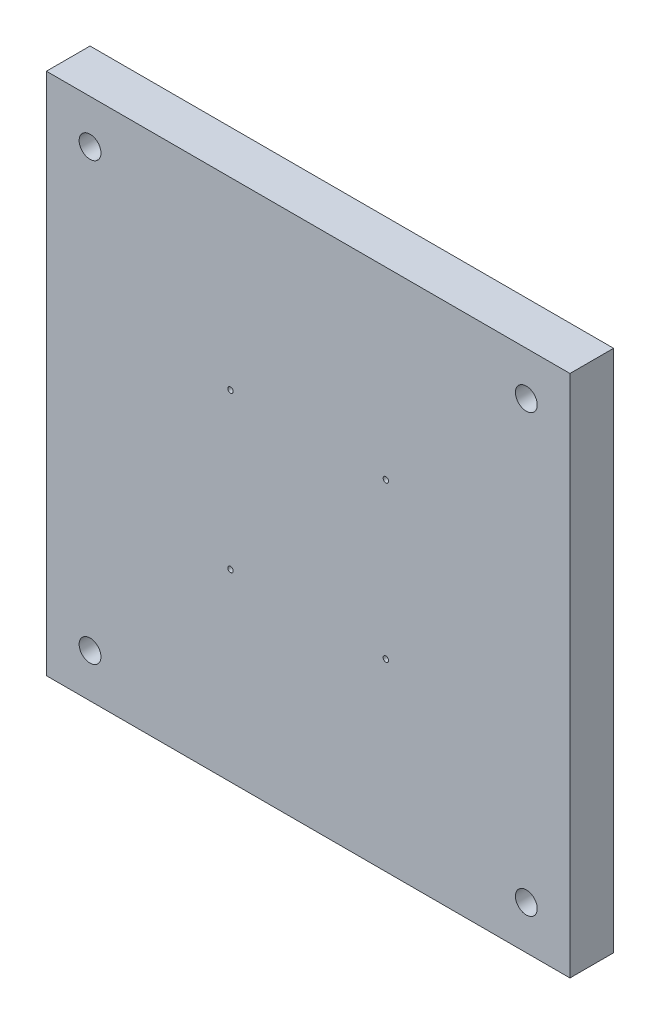
ISO-10303-21;
HEADER;
FILE_DESCRIPTION(('STEP AP214'),'2;1');
FILE_NAME('part.step','',(''),(''),'','','');
FILE_SCHEMA(('AUTOMOTIVE_DESIGN { 1 0 10303 214 1 1 1 1 }'));
ENDSEC;
DATA;
#1=APPLICATION_CONTEXT('core data for automotive mechanical design processes');
#2=APPLICATION_PROTOCOL_DEFINITION('international standard','automotive_design',2000,#1);
#3=PRODUCT_CONTEXT('',#1,'mechanical');
#4=PRODUCT('Part','Part','',(#3));
#5=PRODUCT_RELATED_PRODUCT_CATEGORY('part','',(#4));
#6=PRODUCT_DEFINITION_FORMATION('','',#4);
#7=PRODUCT_DEFINITION_CONTEXT('part definition',#1,'design');
#8=PRODUCT_DEFINITION('design','',#6,#7);
#9=PRODUCT_DEFINITION_SHAPE('','',#8);
#10=(LENGTH_UNIT() NAMED_UNIT(*) SI_UNIT(.MILLI.,.METRE.));
#11=(NAMED_UNIT(*) PLANE_ANGLE_UNIT() SI_UNIT($,.RADIAN.));
#12=(NAMED_UNIT(*) SI_UNIT($,.STERADIAN.) SOLID_ANGLE_UNIT());
#13=UNCERTAINTY_MEASURE_WITH_UNIT(LENGTH_MEASURE(1.E-05),#10,'distance_accuracy_value','');
#14=(GEOMETRIC_REPRESENTATION_CONTEXT(3) GLOBAL_UNCERTAINTY_ASSIGNED_CONTEXT((#13)) GLOBAL_UNIT_ASSIGNED_CONTEXT((#10,
#11,#12)) REPRESENTATION_CONTEXT('',''));
#15=CARTESIAN_POINT('',(0.,0.,0.));
#16=DIRECTION('',(0.,0.,1.));
#17=DIRECTION('',(1.,0.,0.));
#18=AXIS2_PLACEMENT_3D('',#15,#16,#17);
#19=CARTESIAN_POINT('',(0.,0.,6.35));
#20=DIRECTION('',(1.,0.,0.));
#21=DIRECTION('',(0.,0.,-1.));
#22=AXIS2_PLACEMENT_3D('',#19,#20,#21);
#23=PLANE('',#22);
#24=DIRECTION('',(0.,-1.,0.));
#25=VECTOR('',#24,1.);
#26=CARTESIAN_POINT('',(0.,0.,0.));
#27=LINE('',#26,#25);
#28=CARTESIAN_POINT('',(0.,76.2,0.));
#29=VERTEX_POINT('',#28);
#30=CARTESIAN_POINT('',(0.,0.,0.));
#31=VERTEX_POINT('',#30);
#32=EDGE_CURVE('E96',#29,#31,#27,.T.);
#33=ORIENTED_EDGE('',*,*,#32,.T.);
#34=DIRECTION('',(0.,0.,-1.));
#35=VECTOR('',#34,1.);
#36=CARTESIAN_POINT('',(0.,0.,6.35));
#37=LINE('',#36,#35);
#38=CARTESIAN_POINT('',(0.,0.,6.35));
#39=VERTEX_POINT('',#38);
#40=EDGE_CURVE('E11',#39,#31,#37,.T.);
#41=ORIENTED_EDGE('',*,*,#40,.F.);
#42=DIRECTION('',(0.,-1.,0.));
#43=VECTOR('',#42,1.);
#44=CARTESIAN_POINT('',(0.,0.,6.35));
#45=LINE('',#44,#43);
#46=CARTESIAN_POINT('',(0.,76.2,6.35));
#47=VERTEX_POINT('',#46);
#48=EDGE_CURVE('E84',#47,#39,#45,.T.);
#49=ORIENTED_EDGE('',*,*,#48,.F.);
#50=DIRECTION('',(0.,0.,-1.));
#51=VECTOR('',#50,1.);
#52=CARTESIAN_POINT('',(0.,76.2,6.35));
#53=LINE('',#52,#51);
#54=EDGE_CURVE('E92',#47,#29,#53,.T.);
#55=ORIENTED_EDGE('',*,*,#54,.T.);
#56=EDGE_LOOP('',(#33,#41,#49,#55));
#57=FACE_BOUND('',#56,.T.);
#58=ADVANCED_FACE('F33',(#57),#23,.F.);
#59=CARTESIAN_POINT('',(0.,0.,6.35));
#60=DIRECTION('',(0.,1.,0.));
#61=DIRECTION('',(0.,0.,1.));
#62=AXIS2_PLACEMENT_3D('',#59,#60,#61);
#63=PLANE('',#62);
#64=DIRECTION('',(1.,0.,0.));
#65=VECTOR('',#64,1.);
#66=CARTESIAN_POINT('',(0.,0.,0.));
#67=LINE('',#66,#65);
#68=CARTESIAN_POINT('',(76.2,0.,0.));
#69=VERTEX_POINT('',#68);
#70=EDGE_CURVE('E88',#31,#69,#67,.T.);
#71=ORIENTED_EDGE('',*,*,#70,.T.);
#72=DIRECTION('',(0.,0.,-1.));
#73=VECTOR('',#72,1.);
#74=CARTESIAN_POINT('',(76.2,0.,6.35));
#75=LINE('',#74,#73);
#76=CARTESIAN_POINT('',(76.2,0.,6.35));
#77=VERTEX_POINT('',#76);
#78=EDGE_CURVE('E41',#77,#69,#75,.T.);
#79=ORIENTED_EDGE('',*,*,#78,.F.);
#80=DIRECTION('',(1.,0.,0.));
#81=VECTOR('',#80,1.);
#82=CARTESIAN_POINT('',(0.,0.,6.35));
#83=LINE('',#82,#81);
#84=EDGE_CURVE('E79',#39,#77,#83,.T.);
#85=ORIENTED_EDGE('',*,*,#84,.F.);
#86=ORIENTED_EDGE('',*,*,#40,.T.);
#87=EDGE_LOOP('',(#71,#79,#85,#86));
#88=FACE_BOUND('',#87,.T.);
#89=ADVANCED_FACE('F87',(#88),#63,.F.);
#90=CARTESIAN_POINT('',(76.2,0.,6.35));
#91=DIRECTION('',(-1.,0.,0.));
#92=DIRECTION('',(0.,0.,1.));
#93=AXIS2_PLACEMENT_3D('',#90,#91,#92);
#94=PLANE('',#93);
#95=DIRECTION('',(0.,1.,0.));
#96=VECTOR('',#95,1.);
#97=CARTESIAN_POINT('',(76.2,0.,0.));
#98=LINE('',#97,#96);
#99=CARTESIAN_POINT('',(76.2,76.2,0.));
#100=VERTEX_POINT('',#99);
#101=EDGE_CURVE('E66',#69,#100,#98,.T.);
#102=ORIENTED_EDGE('',*,*,#101,.T.);
#103=DIRECTION('',(0.,0.,-1.));
#104=VECTOR('',#103,1.);
#105=CARTESIAN_POINT('',(76.2,76.2,6.35));
#106=LINE('',#105,#104);
#107=CARTESIAN_POINT('',(76.2,76.2,6.35));
#108=VERTEX_POINT('',#107);
#109=EDGE_CURVE('E89',#108,#100,#106,.T.);
#110=ORIENTED_EDGE('',*,*,#109,.F.);
#111=DIRECTION('',(0.,1.,0.));
#112=VECTOR('',#111,1.);
#113=CARTESIAN_POINT('',(76.2,0.,6.35));
#114=LINE('',#113,#112);
#115=EDGE_CURVE('E82',#77,#108,#114,.T.);
#116=ORIENTED_EDGE('',*,*,#115,.F.);
#117=ORIENTED_EDGE('',*,*,#78,.T.);
#118=EDGE_LOOP('',(#102,#110,#116,#117));
#119=FACE_BOUND('',#118,.T.);
#120=ADVANCED_FACE('F90',(#119),#94,.F.);
#121=CARTESIAN_POINT('',(0.,76.2,6.35));
#122=DIRECTION('',(0.,-1.,0.));
#123=DIRECTION('',(0.,0.,-1.));
#124=AXIS2_PLACEMENT_3D('',#121,#122,#123);
#125=PLANE('',#124);
#126=DIRECTION('',(-1.,0.,0.));
#127=VECTOR('',#126,1.);
#128=CARTESIAN_POINT('',(0.,76.2,0.));
#129=LINE('',#128,#127);
#130=EDGE_CURVE('E72',#100,#29,#129,.T.);
#131=ORIENTED_EDGE('',*,*,#130,.T.);
#132=ORIENTED_EDGE('',*,*,#54,.F.);
#133=DIRECTION('',(-1.,0.,0.));
#134=VECTOR('',#133,1.);
#135=CARTESIAN_POINT('',(0.,76.2,6.35));
#136=LINE('',#135,#134);
#137=EDGE_CURVE('E49',#108,#47,#136,.T.);
#138=ORIENTED_EDGE('',*,*,#137,.F.);
#139=ORIENTED_EDGE('',*,*,#109,.T.);
#140=EDGE_LOOP('',(#131,#132,#138,#139));
#141=FACE_BOUND('',#140,.T.);
#142=ADVANCED_FACE('F104',(#141),#125,.F.);
#143=CARTESIAN_POINT('',(0.,0.,6.35));
#144=DIRECTION('',(0.,0.,-1.));
#145=DIRECTION('',(-1.,0.,0.));
#146=AXIS2_PLACEMENT_3D('',#143,#144,#145);
#147=PLANE('',#146);
#148=CARTESIAN_POINT('',(69.8499999999999,6.35,6.35));
#149=DIRECTION('',(0.,0.,-1.));
#150=DIRECTION('',(-1.,0.,0.));
#151=AXIS2_PLACEMENT_3D('',#148,#149,#150);
#152=CIRCLE('',#151,1.5875);
#153=CARTESIAN_POINT('',(68.2624999999999,6.35,6.35));
#154=VERTEX_POINT('',#153);
#155=EDGE_CURVE('E149',#154,#154,#152,.T.);
#156=ORIENTED_EDGE('',*,*,#155,.T.);
#157=EDGE_LOOP('',(#156));
#158=FACE_BOUND('',#157,.T.);
#159=CARTESIAN_POINT('',(69.85,69.8499999999999,6.35));
#160=DIRECTION('',(0.,0.,-1.));
#161=DIRECTION('',(1.,0.,0.));
#162=AXIS2_PLACEMENT_3D('',#159,#160,#161);
#163=CIRCLE('',#162,1.5875);
#164=CARTESIAN_POINT('',(71.4375,69.8499999999999,6.35));
#165=VERTEX_POINT('',#164);
#166=EDGE_CURVE('E143',#165,#165,#163,.T.);
#167=ORIENTED_EDGE('',*,*,#166,.T.);
#168=EDGE_LOOP('',(#167));
#169=FACE_BOUND('',#168,.T.);
#170=CARTESIAN_POINT('',(6.35000000000003,6.35000000000002,6.35));
#171=DIRECTION('',(0.,0.,-1.));
#172=DIRECTION('',(1.,0.,0.));
#173=AXIS2_PLACEMENT_3D('',#170,#171,#172);
#174=CIRCLE('',#173,1.5875);
#175=CARTESIAN_POINT('',(7.93750000000003,6.35000000000002,6.35));
#176=VERTEX_POINT('',#175);
#177=EDGE_CURVE('E137',#176,#176,#174,.T.);
#178=ORIENTED_EDGE('',*,*,#177,.T.);
#179=EDGE_LOOP('',(#178));
#180=FACE_BOUND('',#179,.T.);
#181=CARTESIAN_POINT('',(6.35,69.85,6.35));
#182=DIRECTION('',(0.,0.,-1.));
#183=DIRECTION('',(-1.,0.,0.));
#184=AXIS2_PLACEMENT_3D('',#181,#182,#183);
#185=CIRCLE('',#184,1.5875);
#186=CARTESIAN_POINT('',(4.7625,69.85,6.35));
#187=VERTEX_POINT('',#186);
#188=EDGE_CURVE('E131',#187,#187,#185,.T.);
#189=ORIENTED_EDGE('',*,*,#188,.T.);
#190=EDGE_LOOP('',(#189));
#191=FACE_BOUND('',#190,.T.);
#192=CARTESIAN_POINT('',(49.4030000000001,26.797,6.35));
#193=DIRECTION('',(0.,0.,1.));
#194=DIRECTION('',(1.,0.,0.));
#195=AXIS2_PLACEMENT_3D('',#192,#193,#194);
#196=CIRCLE('',#195,0.396874999999996);
#197=CARTESIAN_POINT('',(49.7998750000001,26.797,6.35));
#198=VERTEX_POINT('',#197);
#199=EDGE_CURVE('E128',#198,#198,#196,.T.);
#200=ORIENTED_EDGE('',*,*,#199,.F.);
#201=EDGE_LOOP('',(#200));
#202=FACE_BOUND('',#201,.T.);
#203=CARTESIAN_POINT('',(26.7970000000001,49.403,6.35));
#204=DIRECTION('',(0.,0.,1.));
#205=DIRECTION('',(1.,0.,0.));
#206=AXIS2_PLACEMENT_3D('',#203,#204,#205);
#207=CIRCLE('',#206,0.396875);
#208=CARTESIAN_POINT('',(27.1938750000001,49.403,6.35));
#209=VERTEX_POINT('',#208);
#210=EDGE_CURVE('E122',#209,#209,#207,.T.);
#211=ORIENTED_EDGE('',*,*,#210,.F.);
#212=EDGE_LOOP('',(#211));
#213=FACE_BOUND('',#212,.T.);
#214=CARTESIAN_POINT('',(26.7970000000001,26.797,6.35));
#215=DIRECTION('',(0.,0.,1.));
#216=DIRECTION('',(1.,0.,0.));
#217=AXIS2_PLACEMENT_3D('',#214,#215,#216);
#218=CIRCLE('',#217,0.396875);
#219=CARTESIAN_POINT('',(27.1938750000001,26.797,6.35));
#220=VERTEX_POINT('',#219);
#221=EDGE_CURVE('E116',#220,#220,#218,.T.);
#222=ORIENTED_EDGE('',*,*,#221,.F.);
#223=EDGE_LOOP('',(#222));
#224=FACE_BOUND('',#223,.T.);
#225=CARTESIAN_POINT('',(49.4030000000001,49.403,6.35));
#226=DIRECTION('',(0.,0.,1.));
#227=DIRECTION('',(1.,0.,0.));
#228=AXIS2_PLACEMENT_3D('',#225,#226,#227);
#229=CIRCLE('',#228,0.396874999999996);
#230=CARTESIAN_POINT('',(49.7998750000001,49.403,6.35));
#231=VERTEX_POINT('',#230);
#232=EDGE_CURVE('E110',#231,#231,#229,.T.);
#233=ORIENTED_EDGE('',*,*,#232,.F.);
#234=EDGE_LOOP('',(#233));
#235=FACE_BOUND('',#234,.T.);
#236=ORIENTED_EDGE('',*,*,#48,.T.);
#237=ORIENTED_EDGE('',*,*,#84,.T.);
#238=ORIENTED_EDGE('',*,*,#115,.T.);
#239=ORIENTED_EDGE('',*,*,#137,.T.);
#240=EDGE_LOOP('',(#236,#237,#238,#239));
#241=FACE_BOUND('',#240,.T.);
#242=ADVANCED_FACE('F80',(#158,#169,#180,#191,#202,#213,#224,#235,#241),#147,.F.);
#243=CARTESIAN_POINT('',(0.,0.,0.));
#244=DIRECTION('',(0.,0.,-1.));
#245=DIRECTION('',(-1.,0.,0.));
#246=AXIS2_PLACEMENT_3D('',#243,#244,#245);
#247=PLANE('',#246);
#248=CARTESIAN_POINT('',(69.8499999999999,6.35,0.));
#249=DIRECTION('',(0.,0.,-1.));
#250=DIRECTION('',(-1.,0.,0.));
#251=AXIS2_PLACEMENT_3D('',#248,#249,#250);
#252=CIRCLE('',#251,1.5875);
#253=CARTESIAN_POINT('',(68.2624999999999,6.35,0.));
#254=VERTEX_POINT('',#253);
#255=EDGE_CURVE('E152',#254,#254,#252,.T.);
#256=ORIENTED_EDGE('',*,*,#255,.F.);
#257=EDGE_LOOP('',(#256));
#258=FACE_BOUND('',#257,.T.);
#259=CARTESIAN_POINT('',(69.85,69.8499999999999,0.));
#260=DIRECTION('',(0.,0.,-1.));
#261=DIRECTION('',(1.,0.,0.));
#262=AXIS2_PLACEMENT_3D('',#259,#260,#261);
#263=CIRCLE('',#262,1.5875);
#264=CARTESIAN_POINT('',(71.4375,69.8499999999999,0.));
#265=VERTEX_POINT('',#264);
#266=EDGE_CURVE('E146',#265,#265,#263,.T.);
#267=ORIENTED_EDGE('',*,*,#266,.F.);
#268=EDGE_LOOP('',(#267));
#269=FACE_BOUND('',#268,.T.);
#270=CARTESIAN_POINT('',(6.35000000000003,6.35000000000002,0.));
#271=DIRECTION('',(0.,0.,-1.));
#272=DIRECTION('',(1.,0.,0.));
#273=AXIS2_PLACEMENT_3D('',#270,#271,#272);
#274=CIRCLE('',#273,1.5875);
#275=CARTESIAN_POINT('',(7.93750000000003,6.35000000000002,0.));
#276=VERTEX_POINT('',#275);
#277=EDGE_CURVE('E140',#276,#276,#274,.T.);
#278=ORIENTED_EDGE('',*,*,#277,.F.);
#279=EDGE_LOOP('',(#278));
#280=FACE_BOUND('',#279,.T.);
#281=CARTESIAN_POINT('',(6.35,69.85,0.));
#282=DIRECTION('',(0.,0.,-1.));
#283=DIRECTION('',(-1.,0.,0.));
#284=AXIS2_PLACEMENT_3D('',#281,#282,#283);
#285=CIRCLE('',#284,1.5875);
#286=CARTESIAN_POINT('',(4.7625,69.85,0.));
#287=VERTEX_POINT('',#286);
#288=EDGE_CURVE('E134',#287,#287,#285,.T.);
#289=ORIENTED_EDGE('',*,*,#288,.F.);
#290=EDGE_LOOP('',(#289));
#291=FACE_BOUND('',#290,.T.);
#292=CARTESIAN_POINT('',(49.4030000000001,26.797,0.));
#293=DIRECTION('',(0.,0.,1.));
#294=DIRECTION('',(1.,0.,0.));
#295=AXIS2_PLACEMENT_3D('',#292,#293,#294);
#296=CIRCLE('',#295,0.396874999999996);
#297=CARTESIAN_POINT('',(49.7998750000001,26.797,0.));
#298=VERTEX_POINT('',#297);
#299=EDGE_CURVE('E125',#298,#298,#296,.T.);
#300=ORIENTED_EDGE('',*,*,#299,.T.);
#301=EDGE_LOOP('',(#300));
#302=FACE_BOUND('',#301,.T.);
#303=CARTESIAN_POINT('',(26.7970000000001,49.403,0.));
#304=DIRECTION('',(0.,0.,1.));
#305=DIRECTION('',(1.,0.,0.));
#306=AXIS2_PLACEMENT_3D('',#303,#304,#305);
#307=CIRCLE('',#306,0.396875);
#308=CARTESIAN_POINT('',(27.1938750000001,49.403,0.));
#309=VERTEX_POINT('',#308);
#310=EDGE_CURVE('E119',#309,#309,#307,.T.);
#311=ORIENTED_EDGE('',*,*,#310,.T.);
#312=EDGE_LOOP('',(#311));
#313=FACE_BOUND('',#312,.T.);
#314=CARTESIAN_POINT('',(26.7970000000001,26.797,0.));
#315=DIRECTION('',(0.,0.,1.));
#316=DIRECTION('',(1.,0.,0.));
#317=AXIS2_PLACEMENT_3D('',#314,#315,#316);
#318=CIRCLE('',#317,0.396875);
#319=CARTESIAN_POINT('',(27.1938750000001,26.797,0.));
#320=VERTEX_POINT('',#319);
#321=EDGE_CURVE('E113',#320,#320,#318,.T.);
#322=ORIENTED_EDGE('',*,*,#321,.T.);
#323=EDGE_LOOP('',(#322));
#324=FACE_BOUND('',#323,.T.);
#325=CARTESIAN_POINT('',(49.4030000000001,49.403,0.));
#326=DIRECTION('',(0.,0.,1.));
#327=DIRECTION('',(1.,0.,0.));
#328=AXIS2_PLACEMENT_3D('',#325,#326,#327);
#329=CIRCLE('',#328,0.396874999999996);
#330=CARTESIAN_POINT('',(49.7998750000001,49.403,0.));
#331=VERTEX_POINT('',#330);
#332=EDGE_CURVE('E99',#331,#331,#329,.T.);
#333=ORIENTED_EDGE('',*,*,#332,.T.);
#334=EDGE_LOOP('',(#333));
#335=FACE_BOUND('',#334,.T.);
#336=ORIENTED_EDGE('',*,*,#32,.F.);
#337=ORIENTED_EDGE('',*,*,#130,.F.);
#338=ORIENTED_EDGE('',*,*,#101,.F.);
#339=ORIENTED_EDGE('',*,*,#70,.F.);
#340=EDGE_LOOP('',(#336,#337,#338,#339));
#341=FACE_BOUND('',#340,.T.);
#342=ADVANCED_FACE('F107',(#258,#269,#280,#291,#302,#313,#324,#335,#341),#247,.T.);
#343=CARTESIAN_POINT('',(49.4030000000001,49.403,0.));
#344=DIRECTION('',(0.,0.,1.));
#345=DIRECTION('',(1.,0.,0.));
#346=AXIS2_PLACEMENT_3D('',#343,#344,#345);
#347=CYLINDRICAL_SURFACE('',#346,0.396874999999996);
#348=ORIENTED_EDGE('',*,*,#332,.F.);
#349=EDGE_LOOP('',(#348));
#350=FACE_BOUND('',#349,.T.);
#351=ORIENTED_EDGE('',*,*,#232,.T.);
#352=EDGE_LOOP('',(#351));
#353=FACE_BOUND('',#352,.T.);
#354=ADVANCED_FACE('F169',(#350,#353),#347,.F.);
#355=CARTESIAN_POINT('',(26.7970000000001,26.797,0.));
#356=DIRECTION('',(0.,0.,1.));
#357=DIRECTION('',(1.,0.,0.));
#358=AXIS2_PLACEMENT_3D('',#355,#356,#357);
#359=CYLINDRICAL_SURFACE('',#358,0.396875);
#360=ORIENTED_EDGE('',*,*,#321,.F.);
#361=EDGE_LOOP('',(#360));
#362=FACE_BOUND('',#361,.T.);
#363=ORIENTED_EDGE('',*,*,#221,.T.);
#364=EDGE_LOOP('',(#363));
#365=FACE_BOUND('',#364,.T.);
#366=ADVANCED_FACE('F187',(#362,#365),#359,.F.);
#367=CARTESIAN_POINT('',(26.7970000000001,49.403,0.));
#368=DIRECTION('',(0.,0.,1.));
#369=DIRECTION('',(1.,0.,0.));
#370=AXIS2_PLACEMENT_3D('',#367,#368,#369);
#371=CYLINDRICAL_SURFACE('',#370,0.396875);
#372=ORIENTED_EDGE('',*,*,#310,.F.);
#373=EDGE_LOOP('',(#372));
#374=FACE_BOUND('',#373,.T.);
#375=ORIENTED_EDGE('',*,*,#210,.T.);
#376=EDGE_LOOP('',(#375));
#377=FACE_BOUND('',#376,.T.);
#378=ADVANCED_FACE('F233',(#374,#377),#371,.F.);
#379=CARTESIAN_POINT('',(49.4030000000001,26.797,0.));
#380=DIRECTION('',(0.,0.,1.));
#381=DIRECTION('',(1.,0.,0.));
#382=AXIS2_PLACEMENT_3D('',#379,#380,#381);
#383=CYLINDRICAL_SURFACE('',#382,0.396874999999996);
#384=ORIENTED_EDGE('',*,*,#299,.F.);
#385=EDGE_LOOP('',(#384));
#386=FACE_BOUND('',#385,.T.);
#387=ORIENTED_EDGE('',*,*,#199,.T.);
#388=EDGE_LOOP('',(#387));
#389=FACE_BOUND('',#388,.T.);
#390=ADVANCED_FACE('F241',(#386,#389),#383,.F.);
#391=CARTESIAN_POINT('',(6.35,69.85,6.35));
#392=DIRECTION('',(0.,0.,-1.));
#393=DIRECTION('',(-1.,0.,0.));
#394=AXIS2_PLACEMENT_3D('',#391,#392,#393);
#395=CYLINDRICAL_SURFACE('',#394,1.5875);
#396=ORIENTED_EDGE('',*,*,#188,.F.);
#397=EDGE_LOOP('',(#396));
#398=FACE_BOUND('',#397,.T.);
#399=ORIENTED_EDGE('',*,*,#288,.T.);
#400=EDGE_LOOP('',(#399));
#401=FACE_BOUND('',#400,.T.);
#402=ADVANCED_FACE('F248',(#398,#401),#395,.F.);
#403=CARTESIAN_POINT('',(6.35000000000003,6.35000000000002,6.35));
#404=DIRECTION('',(0.,0.,-1.));
#405=DIRECTION('',(-1.,0.,0.));
#406=AXIS2_PLACEMENT_3D('',#403,#404,#405);
#407=CYLINDRICAL_SURFACE('',#406,1.5875);
#408=ORIENTED_EDGE('',*,*,#177,.F.);
#409=EDGE_LOOP('',(#408));
#410=FACE_BOUND('',#409,.T.);
#411=ORIENTED_EDGE('',*,*,#277,.T.);
#412=EDGE_LOOP('',(#411));
#413=FACE_BOUND('',#412,.T.);
#414=ADVANCED_FACE('F255',(#410,#413),#407,.F.);
#415=CARTESIAN_POINT('',(69.85,69.8499999999999,6.35));
#416=DIRECTION('',(0.,0.,-1.));
#417=DIRECTION('',(-1.,0.,0.));
#418=AXIS2_PLACEMENT_3D('',#415,#416,#417);
#419=CYLINDRICAL_SURFACE('',#418,1.5875);
#420=ORIENTED_EDGE('',*,*,#166,.F.);
#421=EDGE_LOOP('',(#420));
#422=FACE_BOUND('',#421,.T.);
#423=ORIENTED_EDGE('',*,*,#266,.T.);
#424=EDGE_LOOP('',(#423));
#425=FACE_BOUND('',#424,.T.);
#426=ADVANCED_FACE('F163',(#422,#425),#419,.F.);
#427=CARTESIAN_POINT('',(69.8499999999999,6.35,6.35));
#428=DIRECTION('',(0.,0.,-1.));
#429=DIRECTION('',(-1.,0.,0.));
#430=AXIS2_PLACEMENT_3D('',#427,#428,#429);
#431=CYLINDRICAL_SURFACE('',#430,1.5875);
#432=ORIENTED_EDGE('',*,*,#155,.F.);
#433=EDGE_LOOP('',(#432));
#434=FACE_BOUND('',#433,.T.);
#435=ORIENTED_EDGE('',*,*,#255,.T.);
#436=EDGE_LOOP('',(#435));
#437=FACE_BOUND('',#436,.T.);
#438=ADVANCED_FACE('F160',(#434,#437),#431,.F.);
#439=CLOSED_SHELL('',(#58,#89,#120,#142,#242,#342,#354,#366,#378,#390,#402,#414,#426,#438));
#440=MANIFOLD_SOLID_BREP('B2',#439);
#441=ADVANCED_BREP_SHAPE_REPRESENTATION('',(#18,#440),#14);
#442=SHAPE_DEFINITION_REPRESENTATION(#9,#441);
ENDSEC;
END-ISO-10303-21;
